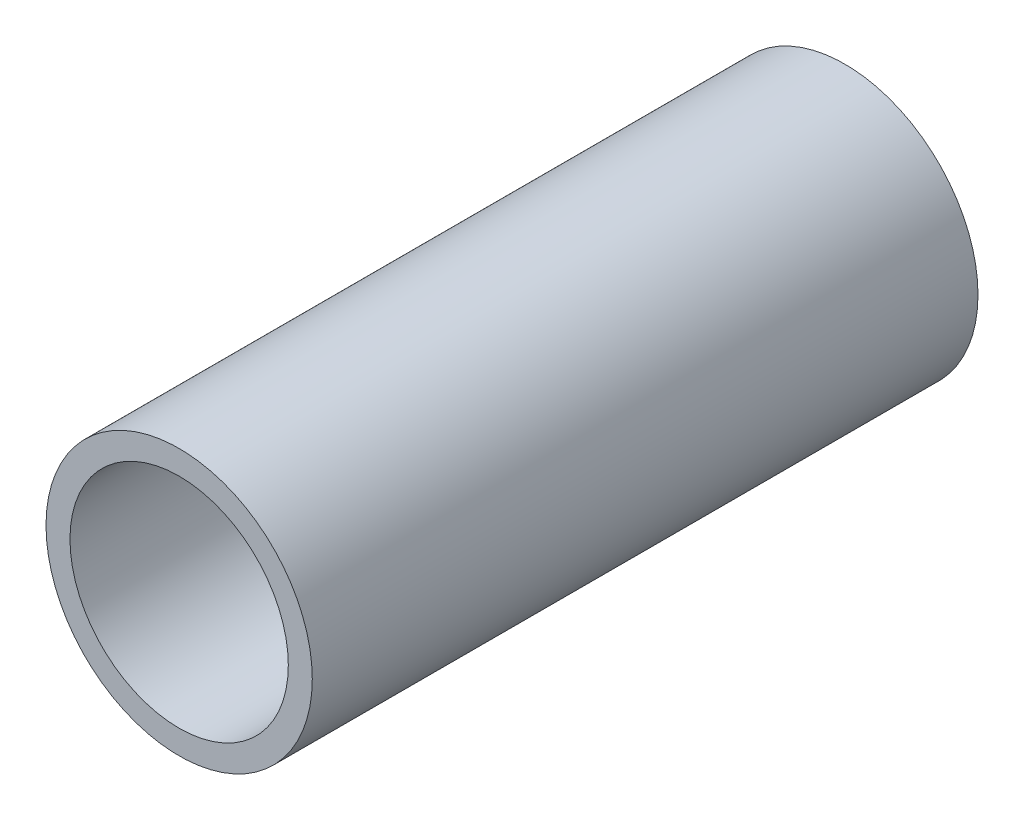
ISO-10303-21;
HEADER;
FILE_DESCRIPTION(('STEP AP214'),'2;1');
FILE_NAME('part.step','',(''),(''),'','','');
FILE_SCHEMA(('AUTOMOTIVE_DESIGN { 1 0 10303 214 1 1 1 1 }'));
ENDSEC;
DATA;
#1=APPLICATION_CONTEXT('core data for automotive mechanical design processes');
#2=APPLICATION_PROTOCOL_DEFINITION('international standard','automotive_design',2000,#1);
#3=PRODUCT_CONTEXT('',#1,'mechanical');
#4=PRODUCT('Part','Part','',(#3));
#5=PRODUCT_RELATED_PRODUCT_CATEGORY('part','',(#4));
#6=PRODUCT_DEFINITION_FORMATION('','',#4);
#7=PRODUCT_DEFINITION_CONTEXT('part definition',#1,'design');
#8=PRODUCT_DEFINITION('design','',#6,#7);
#9=PRODUCT_DEFINITION_SHAPE('','',#8);
#10=(LENGTH_UNIT() NAMED_UNIT(*) SI_UNIT(.MILLI.,.METRE.));
#11=(NAMED_UNIT(*) PLANE_ANGLE_UNIT() SI_UNIT($,.RADIAN.));
#12=(NAMED_UNIT(*) SI_UNIT($,.STERADIAN.) SOLID_ANGLE_UNIT());
#13=UNCERTAINTY_MEASURE_WITH_UNIT(LENGTH_MEASURE(1.E-05),#10,'distance_accuracy_value','');
#14=(GEOMETRIC_REPRESENTATION_CONTEXT(3) GLOBAL_UNCERTAINTY_ASSIGNED_CONTEXT((#13)) GLOBAL_UNIT_ASSIGNED_CONTEXT((#10,
#11,#12)) REPRESENTATION_CONTEXT('',''));
#15=CARTESIAN_POINT('',(0.,0.,0.));
#16=DIRECTION('',(0.,0.,1.));
#17=DIRECTION('',(1.,0.,0.));
#18=AXIS2_PLACEMENT_3D('',#15,#16,#17);
#19=CARTESIAN_POINT('',(0.,0.,25.));
#20=DIRECTION('',(0.,0.,1.));
#21=DIRECTION('',(1.,0.,0.));
#22=AXIS2_PLACEMENT_3D('',#19,#20,#21);
#23=CYLINDRICAL_SURFACE('',#22,4.1);
#24=CARTESIAN_POINT('',(0.,0.,25.));
#25=DIRECTION('',(0.,0.,1.));
#26=DIRECTION('',(1.,0.,0.));
#27=AXIS2_PLACEMENT_3D('',#24,#25,#26);
#28=CIRCLE('',#27,4.1);
#29=CARTESIAN_POINT('',(4.1,0.,25.));
#30=VERTEX_POINT('',#29);
#31=EDGE_CURVE('E27',#30,#30,#28,.F.);
#32=ORIENTED_EDGE('',*,*,#31,.F.);
#33=EDGE_LOOP('',(#32));
#34=FACE_BOUND('',#33,.T.);
#35=CARTESIAN_POINT('',(0.,0.,0.));
#36=DIRECTION('',(0.,0.,1.));
#37=DIRECTION('',(1.,0.,0.));
#38=AXIS2_PLACEMENT_3D('',#35,#36,#37);
#39=CIRCLE('',#38,4.1);
#40=CARTESIAN_POINT('',(4.1,0.,0.));
#41=VERTEX_POINT('',#40);
#42=EDGE_CURVE('E18',#41,#41,#39,.F.);
#43=ORIENTED_EDGE('',*,*,#42,.T.);
#44=EDGE_LOOP('',(#43));
#45=FACE_BOUND('',#44,.T.);
#46=ADVANCED_FACE('F15',(#34,#45),#23,.F.);
#47=CARTESIAN_POINT('',(0.,0.,0.));
#48=DIRECTION('',(0.,0.,1.));
#49=DIRECTION('',(1.,0.,0.));
#50=AXIS2_PLACEMENT_3D('',#47,#48,#49);
#51=PLANE('',#50);
#52=ORIENTED_EDGE('',*,*,#42,.F.);
#53=EDGE_LOOP('',(#52));
#54=FACE_BOUND('',#53,.T.);
#55=CARTESIAN_POINT('',(0.,0.,0.));
#56=DIRECTION('',(0.,0.,1.));
#57=DIRECTION('',(1.,0.,0.));
#58=AXIS2_PLACEMENT_3D('',#55,#56,#57);
#59=CIRCLE('',#58,5.);
#60=CARTESIAN_POINT('',(5.,0.,0.));
#61=VERTEX_POINT('',#60);
#62=EDGE_CURVE('E22',#61,#61,#59,.T.);
#63=ORIENTED_EDGE('',*,*,#62,.F.);
#64=EDGE_LOOP('',(#63));
#65=FACE_BOUND('',#64,.T.);
#66=ADVANCED_FACE('F36',(#54,#65),#51,.F.);
#67=CARTESIAN_POINT('',(0.,0.,25.));
#68=DIRECTION('',(0.,0.,1.));
#69=DIRECTION('',(1.,0.,0.));
#70=AXIS2_PLACEMENT_3D('',#67,#68,#69);
#71=PLANE('',#70);
#72=ORIENTED_EDGE('',*,*,#31,.T.);
#73=EDGE_LOOP('',(#72));
#74=FACE_BOUND('',#73,.T.);
#75=CARTESIAN_POINT('',(0.,0.,25.));
#76=DIRECTION('',(0.,0.,1.));
#77=DIRECTION('',(1.,0.,0.));
#78=AXIS2_PLACEMENT_3D('',#75,#76,#77);
#79=CIRCLE('',#78,5.);
#80=CARTESIAN_POINT('',(5.,0.,25.));
#81=VERTEX_POINT('',#80);
#82=EDGE_CURVE('E9',#81,#81,#79,.F.);
#83=ORIENTED_EDGE('',*,*,#82,.F.);
#84=EDGE_LOOP('',(#83));
#85=FACE_BOUND('',#84,.T.);
#86=ADVANCED_FACE('F39',(#74,#85),#71,.T.);
#87=CARTESIAN_POINT('',(0.,0.,25.));
#88=DIRECTION('',(0.,0.,1.));
#89=DIRECTION('',(1.,0.,0.));
#90=AXIS2_PLACEMENT_3D('',#87,#88,#89);
#91=CYLINDRICAL_SURFACE('',#90,5.);
#92=ORIENTED_EDGE('',*,*,#62,.T.);
#93=EDGE_LOOP('',(#92));
#94=FACE_BOUND('',#93,.T.);
#95=ORIENTED_EDGE('',*,*,#82,.T.);
#96=EDGE_LOOP('',(#95));
#97=FACE_BOUND('',#96,.T.);
#98=ADVANCED_FACE('F42',(#94,#97),#91,.T.);
#99=CLOSED_SHELL('',(#46,#66,#86,#98));
#100=MANIFOLD_SOLID_BREP('B1',#99);
#101=ADVANCED_BREP_SHAPE_REPRESENTATION('',(#18,#100),#14);
#102=SHAPE_DEFINITION_REPRESENTATION(#9,#101);
ENDSEC;
END-ISO-10303-21;
